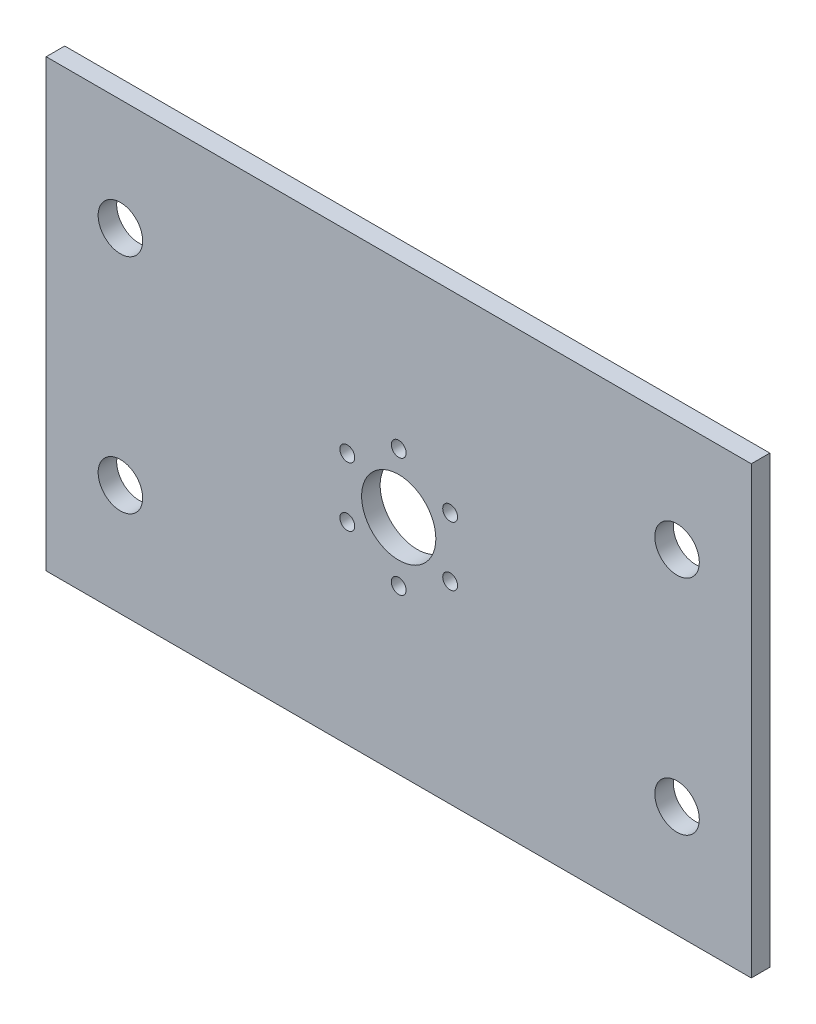
ISO-10303-21;
HEADER;
FILE_DESCRIPTION(('STEP AP214'),'2;1');
FILE_NAME('part.step','',(''),(''),'','','');
FILE_SCHEMA(('AUTOMOTIVE_DESIGN { 1 0 10303 214 1 1 1 1 }'));
ENDSEC;
DATA;
#1=APPLICATION_CONTEXT('core data for automotive mechanical design processes');
#2=APPLICATION_PROTOCOL_DEFINITION('international standard','automotive_design',2000,#1);
#3=PRODUCT_CONTEXT('',#1,'mechanical');
#4=PRODUCT('Part','Part','',(#3));
#5=PRODUCT_RELATED_PRODUCT_CATEGORY('part','',(#4));
#6=PRODUCT_DEFINITION_FORMATION('','',#4);
#7=PRODUCT_DEFINITION_CONTEXT('part definition',#1,'design');
#8=PRODUCT_DEFINITION('design','',#6,#7);
#9=PRODUCT_DEFINITION_SHAPE('','',#8);
#10=(LENGTH_UNIT() NAMED_UNIT(*) SI_UNIT(.MILLI.,.METRE.));
#11=(NAMED_UNIT(*) PLANE_ANGLE_UNIT() SI_UNIT($,.RADIAN.));
#12=(NAMED_UNIT(*) SI_UNIT($,.STERADIAN.) SOLID_ANGLE_UNIT());
#13=UNCERTAINTY_MEASURE_WITH_UNIT(LENGTH_MEASURE(1.E-05),#10,'distance_accuracy_value','');
#14=(GEOMETRIC_REPRESENTATION_CONTEXT(3) GLOBAL_UNCERTAINTY_ASSIGNED_CONTEXT((#13)) GLOBAL_UNIT_ASSIGNED_CONTEXT((#10,
#11,#12)) REPRESENTATION_CONTEXT('',''));
#15=CARTESIAN_POINT('',(0.,0.,0.));
#16=DIRECTION('',(0.,0.,1.));
#17=DIRECTION('',(1.,0.,0.));
#18=AXIS2_PLACEMENT_3D('',#15,#16,#17);
#19=CARTESIAN_POINT('',(0.,0.,5.));
#20=DIRECTION('',(0.,0.,1.));
#21=DIRECTION('',(1.,0.,0.));
#22=AXIS2_PLACEMENT_3D('',#19,#20,#21);
#23=PLANE('',#22);
#24=CARTESIAN_POINT('',(-13.8564064605511,-7.99999999999987,5.));
#25=DIRECTION('',(0.,0.,1.));
#26=DIRECTION('',(1.,0.,0.));
#27=AXIS2_PLACEMENT_3D('',#24,#25,#26);
#28=CIRCLE('',#27,2.);
#29=CARTESIAN_POINT('',(-11.8564064605511,-7.99999999999987,5.));
#30=VERTEX_POINT('',#29);
#31=EDGE_CURVE('E198',#30,#30,#28,.T.);
#32=ORIENTED_EDGE('',*,*,#31,.F.);
#33=EDGE_LOOP('',(#32));
#34=FACE_BOUND('',#33,.T.);
#35=CARTESIAN_POINT('',(13.856406460551,-8.00000000000007,5.));
#36=DIRECTION('',(0.,0.,1.));
#37=DIRECTION('',(1.,0.,0.));
#38=AXIS2_PLACEMENT_3D('',#35,#36,#37);
#39=CIRCLE('',#38,2.);
#40=CARTESIAN_POINT('',(15.856406460551,-8.00000000000007,5.));
#41=VERTEX_POINT('',#40);
#42=EDGE_CURVE('E182',#41,#41,#39,.T.);
#43=ORIENTED_EDGE('',*,*,#42,.F.);
#44=EDGE_LOOP('',(#43));
#45=FACE_BOUND('',#44,.T.);
#46=CARTESIAN_POINT('',(0.,16.,5.));
#47=DIRECTION('',(0.,0.,1.));
#48=DIRECTION('',(1.,0.,0.));
#49=AXIS2_PLACEMENT_3D('',#46,#47,#48);
#50=CIRCLE('',#49,2.);
#51=CARTESIAN_POINT('',(2.,16.,5.));
#52=VERTEX_POINT('',#51);
#53=EDGE_CURVE('E166',#52,#52,#50,.T.);
#54=ORIENTED_EDGE('',*,*,#53,.F.);
#55=EDGE_LOOP('',(#54));
#56=FACE_BOUND('',#55,.T.);
#57=CARTESIAN_POINT('',(-75.,-30.,5.));
#58=DIRECTION('',(0.,0.,1.));
#59=DIRECTION('',(1.,0.,0.));
#60=AXIS2_PLACEMENT_3D('',#57,#58,#59);
#61=CIRCLE('',#60,6.);
#62=CARTESIAN_POINT('',(-69.,-30.,5.));
#63=VERTEX_POINT('',#62);
#64=EDGE_CURVE('E150',#63,#63,#61,.T.);
#65=ORIENTED_EDGE('',*,*,#64,.F.);
#66=EDGE_LOOP('',(#65));
#67=FACE_BOUND('',#66,.T.);
#68=CARTESIAN_POINT('',(75.,30.,5.));
#69=DIRECTION('',(0.,0.,1.));
#70=DIRECTION('',(1.,0.,0.));
#71=AXIS2_PLACEMENT_3D('',#68,#69,#70);
#72=CIRCLE('',#71,6.);
#73=CARTESIAN_POINT('',(81.,30.,5.));
#74=VERTEX_POINT('',#73);
#75=EDGE_CURVE('E134',#74,#74,#72,.T.);
#76=ORIENTED_EDGE('',*,*,#75,.F.);
#77=EDGE_LOOP('',(#76));
#78=FACE_BOUND('',#77,.T.);
#79=DIRECTION('',(0.,1.,0.));
#80=VECTOR('',#79,1.);
#81=CARTESIAN_POINT('',(95.,60.,5.));
#82=LINE('',#81,#80);
#83=CARTESIAN_POINT('',(95.,-60.,5.));
#84=VERTEX_POINT('',#83);
#85=CARTESIAN_POINT('',(95.,60.,5.));
#86=VERTEX_POINT('',#85);
#87=EDGE_CURVE('E92',#84,#86,#82,.T.);
#88=ORIENTED_EDGE('',*,*,#87,.T.);
#89=DIRECTION('',(-1.,0.,0.));
#90=VECTOR('',#89,1.);
#91=CARTESIAN_POINT('',(-95.,60.0000000000001,5.));
#92=LINE('',#91,#90);
#93=CARTESIAN_POINT('',(-95.,60.0000000000001,5.));
#94=VERTEX_POINT('',#93);
#95=EDGE_CURVE('E87',#86,#94,#92,.T.);
#96=ORIENTED_EDGE('',*,*,#95,.T.);
#97=DIRECTION('',(0.,-1.,0.));
#98=VECTOR('',#97,1.);
#99=CARTESIAN_POINT('',(-95.,60.0000000000001,5.));
#100=LINE('',#99,#98);
#101=CARTESIAN_POINT('',(-95.,-60.,5.));
#102=VERTEX_POINT('',#101);
#103=EDGE_CURVE('E90',#94,#102,#100,.T.);
#104=ORIENTED_EDGE('',*,*,#103,.T.);
#105=DIRECTION('',(1.,0.,0.));
#106=VECTOR('',#105,1.);
#107=CARTESIAN_POINT('',(-95.,-60.,5.));
#108=LINE('',#107,#106);
#109=EDGE_CURVE('E57',#102,#84,#108,.T.);
#110=ORIENTED_EDGE('',*,*,#109,.T.);
#111=EDGE_LOOP('',(#88,#96,#104,#110));
#112=FACE_BOUND('',#111,.T.);
#113=CARTESIAN_POINT('',(-75.,30.,5.));
#114=DIRECTION('',(0.,0.,1.));
#115=DIRECTION('',(1.,0.,0.));
#116=AXIS2_PLACEMENT_3D('',#113,#114,#115);
#117=CIRCLE('',#116,6.);
#118=CARTESIAN_POINT('',(-69.,30.,5.));
#119=VERTEX_POINT('',#118);
#120=EDGE_CURVE('E112',#119,#119,#117,.T.);
#121=ORIENTED_EDGE('',*,*,#120,.F.);
#122=EDGE_LOOP('',(#121));
#123=FACE_BOUND('',#122,.T.);
#124=CARTESIAN_POINT('',(75.,-30.,5.));
#125=DIRECTION('',(0.,0.,1.));
#126=DIRECTION('',(1.,0.,0.));
#127=AXIS2_PLACEMENT_3D('',#124,#125,#126);
#128=CIRCLE('',#127,6.);
#129=CARTESIAN_POINT('',(81.,-30.,5.));
#130=VERTEX_POINT('',#129);
#131=EDGE_CURVE('E142',#130,#130,#128,.T.);
#132=ORIENTED_EDGE('',*,*,#131,.F.);
#133=EDGE_LOOP('',(#132));
#134=FACE_BOUND('',#133,.T.);
#135=CARTESIAN_POINT('',(0.,0.,5.));
#136=DIRECTION('',(0.,0.,1.));
#137=DIRECTION('',(1.,0.,0.));
#138=AXIS2_PLACEMENT_3D('',#135,#136,#137);
#139=CIRCLE('',#138,10.);
#140=CARTESIAN_POINT('',(10.,0.,5.));
#141=VERTEX_POINT('',#140);
#142=EDGE_CURVE('E158',#141,#141,#139,.T.);
#143=ORIENTED_EDGE('',*,*,#142,.F.);
#144=EDGE_LOOP('',(#143));
#145=FACE_BOUND('',#144,.T.);
#146=CARTESIAN_POINT('',(13.856406460551,7.99999999999997,5.));
#147=DIRECTION('',(0.,0.,1.));
#148=DIRECTION('',(1.,0.,0.));
#149=AXIS2_PLACEMENT_3D('',#146,#147,#148);
#150=CIRCLE('',#149,2.);
#151=CARTESIAN_POINT('',(15.856406460551,7.99999999999997,5.));
#152=VERTEX_POINT('',#151);
#153=EDGE_CURVE('E174',#152,#152,#150,.T.);
#154=ORIENTED_EDGE('',*,*,#153,.F.);
#155=EDGE_LOOP('',(#154));
#156=FACE_BOUND('',#155,.T.);
#157=CARTESIAN_POINT('',(-1.1172740284298E-13,-16.,5.));
#158=DIRECTION('',(0.,0.,1.));
#159=DIRECTION('',(1.,0.,0.));
#160=AXIS2_PLACEMENT_3D('',#157,#158,#159);
#161=CIRCLE('',#160,2.);
#162=CARTESIAN_POINT('',(1.99999999999989,-16.,5.));
#163=VERTEX_POINT('',#162);
#164=EDGE_CURVE('E190',#163,#163,#161,.T.);
#165=ORIENTED_EDGE('',*,*,#164,.F.);
#166=EDGE_LOOP('',(#165));
#167=FACE_BOUND('',#166,.T.);
#168=CARTESIAN_POINT('',(-13.8564064605509,8.00000000000016,5.));
#169=DIRECTION('',(0.,0.,1.));
#170=DIRECTION('',(1.,0.,0.));
#171=AXIS2_PLACEMENT_3D('',#168,#169,#170);
#172=CIRCLE('',#171,2.);
#173=CARTESIAN_POINT('',(-11.8564064605509,8.00000000000016,5.));
#174=VERTEX_POINT('',#173);
#175=EDGE_CURVE('E206',#174,#174,#172,.T.);
#176=ORIENTED_EDGE('',*,*,#175,.F.);
#177=EDGE_LOOP('',(#176));
#178=FACE_BOUND('',#177,.T.);
#179=ADVANCED_FACE('F39',(#34,#45,#56,#67,#78,#112,#123,#134,#145,#156,#167,#178),#23,.T.);
#180=CARTESIAN_POINT('',(0.,0.,0.));
#181=DIRECTION('',(0.,0.,1.));
#182=DIRECTION('',(1.,0.,0.));
#183=AXIS2_PLACEMENT_3D('',#180,#181,#182);
#184=PLANE('',#183);
#185=DIRECTION('',(0.,1.,0.));
#186=VECTOR('',#185,1.);
#187=CARTESIAN_POINT('',(95.,60.,0.));
#188=LINE('',#187,#186);
#189=CARTESIAN_POINT('',(95.,-60.,0.));
#190=VERTEX_POINT('',#189);
#191=CARTESIAN_POINT('',(95.,60.,0.));
#192=VERTEX_POINT('',#191);
#193=EDGE_CURVE('E108',#190,#192,#188,.T.);
#194=ORIENTED_EDGE('',*,*,#193,.F.);
#195=DIRECTION('',(1.,0.,0.));
#196=VECTOR('',#195,1.);
#197=CARTESIAN_POINT('',(-95.,-60.,0.));
#198=LINE('',#197,#196);
#199=CARTESIAN_POINT('',(-95.,-60.,0.));
#200=VERTEX_POINT('',#199);
#201=EDGE_CURVE('E80',#200,#190,#198,.T.);
#202=ORIENTED_EDGE('',*,*,#201,.F.);
#203=DIRECTION('',(0.,-1.,0.));
#204=VECTOR('',#203,1.);
#205=CARTESIAN_POINT('',(-95.,60.0000000000001,0.));
#206=LINE('',#205,#204);
#207=CARTESIAN_POINT('',(-95.,60.0000000000001,0.));
#208=VERTEX_POINT('',#207);
#209=EDGE_CURVE('E74',#208,#200,#206,.T.);
#210=ORIENTED_EDGE('',*,*,#209,.F.);
#211=DIRECTION('',(-1.,0.,0.));
#212=VECTOR('',#211,1.);
#213=CARTESIAN_POINT('',(-95.,60.0000000000001,0.));
#214=LINE('',#213,#212);
#215=EDGE_CURVE('E97',#192,#208,#214,.T.);
#216=ORIENTED_EDGE('',*,*,#215,.F.);
#217=EDGE_LOOP('',(#194,#202,#210,#216));
#218=FACE_BOUND('',#217,.T.);
#219=CARTESIAN_POINT('',(-75.,30.,0.));
#220=DIRECTION('',(0.,0.,1.));
#221=DIRECTION('',(1.,0.,0.));
#222=AXIS2_PLACEMENT_3D('',#219,#220,#221);
#223=CIRCLE('',#222,6.);
#224=CARTESIAN_POINT('',(-69.,30.,0.));
#225=VERTEX_POINT('',#224);
#226=EDGE_CURVE('E130',#225,#225,#223,.T.);
#227=ORIENTED_EDGE('',*,*,#226,.T.);
#228=EDGE_LOOP('',(#227));
#229=FACE_BOUND('',#228,.T.);
#230=CARTESIAN_POINT('',(75.,30.,0.));
#231=DIRECTION('',(0.,0.,1.));
#232=DIRECTION('',(1.,0.,0.));
#233=AXIS2_PLACEMENT_3D('',#230,#231,#232);
#234=CIRCLE('',#233,6.);
#235=CARTESIAN_POINT('',(81.,30.,0.));
#236=VERTEX_POINT('',#235);
#237=EDGE_CURVE('E138',#236,#236,#234,.T.);
#238=ORIENTED_EDGE('',*,*,#237,.T.);
#239=EDGE_LOOP('',(#238));
#240=FACE_BOUND('',#239,.T.);
#241=CARTESIAN_POINT('',(75.,-30.,0.));
#242=DIRECTION('',(0.,0.,1.));
#243=DIRECTION('',(1.,0.,0.));
#244=AXIS2_PLACEMENT_3D('',#241,#242,#243);
#245=CIRCLE('',#244,6.);
#246=CARTESIAN_POINT('',(81.,-30.,0.));
#247=VERTEX_POINT('',#246);
#248=EDGE_CURVE('E146',#247,#247,#245,.T.);
#249=ORIENTED_EDGE('',*,*,#248,.T.);
#250=EDGE_LOOP('',(#249));
#251=FACE_BOUND('',#250,.T.);
#252=CARTESIAN_POINT('',(-75.,-30.,0.));
#253=DIRECTION('',(0.,0.,1.));
#254=DIRECTION('',(1.,0.,0.));
#255=AXIS2_PLACEMENT_3D('',#252,#253,#254);
#256=CIRCLE('',#255,6.);
#257=CARTESIAN_POINT('',(-69.,-30.,0.));
#258=VERTEX_POINT('',#257);
#259=EDGE_CURVE('E154',#258,#258,#256,.T.);
#260=ORIENTED_EDGE('',*,*,#259,.T.);
#261=EDGE_LOOP('',(#260));
#262=FACE_BOUND('',#261,.T.);
#263=CARTESIAN_POINT('',(0.,0.,0.));
#264=DIRECTION('',(0.,0.,1.));
#265=DIRECTION('',(1.,0.,0.));
#266=AXIS2_PLACEMENT_3D('',#263,#264,#265);
#267=CIRCLE('',#266,10.);
#268=CARTESIAN_POINT('',(10.,0.,0.));
#269=VERTEX_POINT('',#268);
#270=EDGE_CURVE('E162',#269,#269,#267,.T.);
#271=ORIENTED_EDGE('',*,*,#270,.T.);
#272=EDGE_LOOP('',(#271));
#273=FACE_BOUND('',#272,.T.);
#274=CARTESIAN_POINT('',(0.,16.,0.));
#275=DIRECTION('',(0.,0.,1.));
#276=DIRECTION('',(1.,0.,0.));
#277=AXIS2_PLACEMENT_3D('',#274,#275,#276);
#278=CIRCLE('',#277,2.);
#279=CARTESIAN_POINT('',(2.,16.,0.));
#280=VERTEX_POINT('',#279);
#281=EDGE_CURVE('E170',#280,#280,#278,.T.);
#282=ORIENTED_EDGE('',*,*,#281,.T.);
#283=EDGE_LOOP('',(#282));
#284=FACE_BOUND('',#283,.T.);
#285=CARTESIAN_POINT('',(13.856406460551,7.99999999999997,0.));
#286=DIRECTION('',(0.,0.,1.));
#287=DIRECTION('',(1.,0.,0.));
#288=AXIS2_PLACEMENT_3D('',#285,#286,#287);
#289=CIRCLE('',#288,2.);
#290=CARTESIAN_POINT('',(15.856406460551,7.99999999999997,0.));
#291=VERTEX_POINT('',#290);
#292=EDGE_CURVE('E178',#291,#291,#289,.T.);
#293=ORIENTED_EDGE('',*,*,#292,.T.);
#294=EDGE_LOOP('',(#293));
#295=FACE_BOUND('',#294,.T.);
#296=CARTESIAN_POINT('',(13.856406460551,-8.00000000000007,0.));
#297=DIRECTION('',(0.,0.,1.));
#298=DIRECTION('',(1.,0.,0.));
#299=AXIS2_PLACEMENT_3D('',#296,#297,#298);
#300=CIRCLE('',#299,2.);
#301=CARTESIAN_POINT('',(15.856406460551,-8.00000000000007,0.));
#302=VERTEX_POINT('',#301);
#303=EDGE_CURVE('E186',#302,#302,#300,.T.);
#304=ORIENTED_EDGE('',*,*,#303,.T.);
#305=EDGE_LOOP('',(#304));
#306=FACE_BOUND('',#305,.T.);
#307=CARTESIAN_POINT('',(-1.1172740284298E-13,-16.,0.));
#308=DIRECTION('',(0.,0.,1.));
#309=DIRECTION('',(1.,0.,0.));
#310=AXIS2_PLACEMENT_3D('',#307,#308,#309);
#311=CIRCLE('',#310,2.);
#312=CARTESIAN_POINT('',(1.99999999999989,-16.,0.));
#313=VERTEX_POINT('',#312);
#314=EDGE_CURVE('E194',#313,#313,#311,.T.);
#315=ORIENTED_EDGE('',*,*,#314,.T.);
#316=EDGE_LOOP('',(#315));
#317=FACE_BOUND('',#316,.T.);
#318=CARTESIAN_POINT('',(-13.8564064605511,-7.99999999999987,0.));
#319=DIRECTION('',(0.,0.,1.));
#320=DIRECTION('',(1.,0.,0.));
#321=AXIS2_PLACEMENT_3D('',#318,#319,#320);
#322=CIRCLE('',#321,2.);
#323=CARTESIAN_POINT('',(-11.8564064605511,-7.99999999999987,0.));
#324=VERTEX_POINT('',#323);
#325=EDGE_CURVE('E202',#324,#324,#322,.T.);
#326=ORIENTED_EDGE('',*,*,#325,.T.);
#327=EDGE_LOOP('',(#326));
#328=FACE_BOUND('',#327,.T.);
#329=CARTESIAN_POINT('',(-13.8564064605509,8.00000000000016,0.));
#330=DIRECTION('',(0.,0.,1.));
#331=DIRECTION('',(1.,0.,0.));
#332=AXIS2_PLACEMENT_3D('',#329,#330,#331);
#333=CIRCLE('',#332,2.);
#334=CARTESIAN_POINT('',(-11.8564064605509,8.00000000000016,0.));
#335=VERTEX_POINT('',#334);
#336=EDGE_CURVE('E210',#335,#335,#333,.T.);
#337=ORIENTED_EDGE('',*,*,#336,.T.);
#338=EDGE_LOOP('',(#337));
#339=FACE_BOUND('',#338,.T.);
#340=ADVANCED_FACE('F125',(#218,#229,#240,#251,#262,#273,#284,#295,#306,#317,#328,#339),#184,.F.);
#341=CARTESIAN_POINT('',(95.,60.,5.));
#342=DIRECTION('',(-1.,0.,0.));
#343=DIRECTION('',(0.,-1.,0.));
#344=AXIS2_PLACEMENT_3D('',#341,#342,#343);
#345=PLANE('',#344);
#346=ORIENTED_EDGE('',*,*,#193,.T.);
#347=DIRECTION('',(0.,0.,-1.));
#348=VECTOR('',#347,1.);
#349=CARTESIAN_POINT('',(95.,60.,5.));
#350=LINE('',#349,#348);
#351=EDGE_CURVE('E11',#86,#192,#350,.T.);
#352=ORIENTED_EDGE('',*,*,#351,.F.);
#353=ORIENTED_EDGE('',*,*,#87,.F.);
#354=DIRECTION('',(0.,0.,-1.));
#355=VECTOR('',#354,1.);
#356=CARTESIAN_POINT('',(95.,-60.,5.));
#357=LINE('',#356,#355);
#358=EDGE_CURVE('E104',#84,#190,#357,.T.);
#359=ORIENTED_EDGE('',*,*,#358,.T.);
#360=EDGE_LOOP('',(#346,#352,#353,#359));
#361=FACE_BOUND('',#360,.T.);
#362=ADVANCED_FACE('F41',(#361),#345,.F.);
#363=CARTESIAN_POINT('',(-95.,60.0000000000001,5.));
#364=DIRECTION('',(0.,-1.,0.));
#365=DIRECTION('',(1.,0.,0.));
#366=AXIS2_PLACEMENT_3D('',#363,#364,#365);
#367=PLANE('',#366);
#368=ORIENTED_EDGE('',*,*,#215,.T.);
#369=DIRECTION('',(0.,0.,-1.));
#370=VECTOR('',#369,1.);
#371=CARTESIAN_POINT('',(-95.,60.0000000000001,5.));
#372=LINE('',#371,#370);
#373=EDGE_CURVE('E49',#94,#208,#372,.T.);
#374=ORIENTED_EDGE('',*,*,#373,.F.);
#375=ORIENTED_EDGE('',*,*,#95,.F.);
#376=ORIENTED_EDGE('',*,*,#351,.T.);
#377=EDGE_LOOP('',(#368,#374,#375,#376));
#378=FACE_BOUND('',#377,.T.);
#379=ADVANCED_FACE('F96',(#378),#367,.F.);
#380=CARTESIAN_POINT('',(-95.,60.0000000000001,5.));
#381=DIRECTION('',(1.,0.,0.));
#382=DIRECTION('',(0.,0.,-1.));
#383=AXIS2_PLACEMENT_3D('',#380,#381,#382);
#384=PLANE('',#383);
#385=ORIENTED_EDGE('',*,*,#209,.T.);
#386=DIRECTION('',(0.,0.,-1.));
#387=VECTOR('',#386,1.);
#388=CARTESIAN_POINT('',(-95.,-60.,5.));
#389=LINE('',#388,#387);
#390=EDGE_CURVE('E99',#102,#200,#389,.T.);
#391=ORIENTED_EDGE('',*,*,#390,.F.);
#392=ORIENTED_EDGE('',*,*,#103,.F.);
#393=ORIENTED_EDGE('',*,*,#373,.T.);
#394=EDGE_LOOP('',(#385,#391,#392,#393));
#395=FACE_BOUND('',#394,.T.);
#396=ADVANCED_FACE('F100',(#395),#384,.F.);
#397=CARTESIAN_POINT('',(-95.,-60.,5.));
#398=DIRECTION('',(0.,1.,0.));
#399=DIRECTION('',(0.,0.,1.));
#400=AXIS2_PLACEMENT_3D('',#397,#398,#399);
#401=PLANE('',#400);
#402=ORIENTED_EDGE('',*,*,#201,.T.);
#403=ORIENTED_EDGE('',*,*,#358,.F.);
#404=ORIENTED_EDGE('',*,*,#109,.F.);
#405=ORIENTED_EDGE('',*,*,#390,.T.);
#406=EDGE_LOOP('',(#402,#403,#404,#405));
#407=FACE_BOUND('',#406,.T.);
#408=ADVANCED_FACE('F122',(#407),#401,.F.);
#409=CARTESIAN_POINT('',(-75.,30.,5.));
#410=DIRECTION('',(0.,0.,-1.));
#411=DIRECTION('',(-1.,0.,0.));
#412=AXIS2_PLACEMENT_3D('',#409,#410,#411);
#413=CYLINDRICAL_SURFACE('',#412,6.);
#414=ORIENTED_EDGE('',*,*,#120,.T.);
#415=EDGE_LOOP('',(#414));
#416=FACE_BOUND('',#415,.T.);
#417=ORIENTED_EDGE('',*,*,#226,.F.);
#418=EDGE_LOOP('',(#417));
#419=FACE_BOUND('',#418,.T.);
#420=ADVANCED_FACE('F231',(#416,#419),#413,.F.);
#421=CARTESIAN_POINT('',(75.,30.,5.));
#422=DIRECTION('',(0.,0.,-1.));
#423=DIRECTION('',(-1.,0.,0.));
#424=AXIS2_PLACEMENT_3D('',#421,#422,#423);
#425=CYLINDRICAL_SURFACE('',#424,6.);
#426=ORIENTED_EDGE('',*,*,#75,.T.);
#427=EDGE_LOOP('',(#426));
#428=FACE_BOUND('',#427,.T.);
#429=ORIENTED_EDGE('',*,*,#237,.F.);
#430=EDGE_LOOP('',(#429));
#431=FACE_BOUND('',#430,.T.);
#432=ADVANCED_FACE('F277',(#428,#431),#425,.F.);
#433=CARTESIAN_POINT('',(75.,-30.,5.));
#434=DIRECTION('',(0.,0.,-1.));
#435=DIRECTION('',(-1.,0.,0.));
#436=AXIS2_PLACEMENT_3D('',#433,#434,#435);
#437=CYLINDRICAL_SURFACE('',#436,6.);
#438=ORIENTED_EDGE('',*,*,#131,.T.);
#439=EDGE_LOOP('',(#438));
#440=FACE_BOUND('',#439,.T.);
#441=ORIENTED_EDGE('',*,*,#248,.F.);
#442=EDGE_LOOP('',(#441));
#443=FACE_BOUND('',#442,.T.);
#444=ADVANCED_FACE('F285',(#440,#443),#437,.F.);
#445=CARTESIAN_POINT('',(-75.,-30.,5.));
#446=DIRECTION('',(0.,0.,-1.));
#447=DIRECTION('',(-1.,0.,0.));
#448=AXIS2_PLACEMENT_3D('',#445,#446,#447);
#449=CYLINDRICAL_SURFACE('',#448,6.);
#450=ORIENTED_EDGE('',*,*,#64,.T.);
#451=EDGE_LOOP('',(#450));
#452=FACE_BOUND('',#451,.T.);
#453=ORIENTED_EDGE('',*,*,#259,.F.);
#454=EDGE_LOOP('',(#453));
#455=FACE_BOUND('',#454,.T.);
#456=ADVANCED_FACE('F293',(#452,#455),#449,.F.);
#457=CARTESIAN_POINT('',(0.,0.,5.));
#458=DIRECTION('',(0.,0.,-1.));
#459=DIRECTION('',(-1.,0.,0.));
#460=AXIS2_PLACEMENT_3D('',#457,#458,#459);
#461=CYLINDRICAL_SURFACE('',#460,10.);
#462=ORIENTED_EDGE('',*,*,#142,.T.);
#463=EDGE_LOOP('',(#462));
#464=FACE_BOUND('',#463,.T.);
#465=ORIENTED_EDGE('',*,*,#270,.F.);
#466=EDGE_LOOP('',(#465));
#467=FACE_BOUND('',#466,.T.);
#468=ADVANCED_FACE('F302',(#464,#467),#461,.F.);
#469=CARTESIAN_POINT('',(0.,16.,5.));
#470=DIRECTION('',(0.,0.,-1.));
#471=DIRECTION('',(-1.,0.,0.));
#472=AXIS2_PLACEMENT_3D('',#469,#470,#471);
#473=CYLINDRICAL_SURFACE('',#472,2.);
#474=ORIENTED_EDGE('',*,*,#53,.T.);
#475=EDGE_LOOP('',(#474));
#476=FACE_BOUND('',#475,.T.);
#477=ORIENTED_EDGE('',*,*,#281,.F.);
#478=EDGE_LOOP('',(#477));
#479=FACE_BOUND('',#478,.T.);
#480=ADVANCED_FACE('F311',(#476,#479),#473,.F.);
#481=CARTESIAN_POINT('',(13.856406460551,7.99999999999997,5.));
#482=DIRECTION('',(0.,0.,-1.));
#483=DIRECTION('',(-1.,0.,0.));
#484=AXIS2_PLACEMENT_3D('',#481,#482,#483);
#485=CYLINDRICAL_SURFACE('',#484,2.);
#486=ORIENTED_EDGE('',*,*,#153,.T.);
#487=EDGE_LOOP('',(#486));
#488=FACE_BOUND('',#487,.T.);
#489=ORIENTED_EDGE('',*,*,#292,.F.);
#490=EDGE_LOOP('',(#489));
#491=FACE_BOUND('',#490,.T.);
#492=ADVANCED_FACE('F320',(#488,#491),#485,.F.);
#493=CARTESIAN_POINT('',(13.856406460551,-8.00000000000007,5.));
#494=DIRECTION('',(0.,0.,-1.));
#495=DIRECTION('',(-1.,0.,0.));
#496=AXIS2_PLACEMENT_3D('',#493,#494,#495);
#497=CYLINDRICAL_SURFACE('',#496,2.);
#498=ORIENTED_EDGE('',*,*,#42,.T.);
#499=EDGE_LOOP('',(#498));
#500=FACE_BOUND('',#499,.T.);
#501=ORIENTED_EDGE('',*,*,#303,.F.);
#502=EDGE_LOOP('',(#501));
#503=FACE_BOUND('',#502,.T.);
#504=ADVANCED_FACE('F329',(#500,#503),#497,.F.);
#505=CARTESIAN_POINT('',(-1.1172740284298E-13,-16.,5.));
#506=DIRECTION('',(0.,0.,-1.));
#507=DIRECTION('',(-1.,0.,0.));
#508=AXIS2_PLACEMENT_3D('',#505,#506,#507);
#509=CYLINDRICAL_SURFACE('',#508,2.);
#510=ORIENTED_EDGE('',*,*,#164,.T.);
#511=EDGE_LOOP('',(#510));
#512=FACE_BOUND('',#511,.T.);
#513=ORIENTED_EDGE('',*,*,#314,.F.);
#514=EDGE_LOOP('',(#513));
#515=FACE_BOUND('',#514,.T.);
#516=ADVANCED_FACE('F338',(#512,#515),#509,.F.);
#517=CARTESIAN_POINT('',(-13.8564064605511,-7.99999999999987,5.));
#518=DIRECTION('',(0.,0.,-1.));
#519=DIRECTION('',(-1.,0.,0.));
#520=AXIS2_PLACEMENT_3D('',#517,#518,#519);
#521=CYLINDRICAL_SURFACE('',#520,2.);
#522=ORIENTED_EDGE('',*,*,#31,.T.);
#523=EDGE_LOOP('',(#522));
#524=FACE_BOUND('',#523,.T.);
#525=ORIENTED_EDGE('',*,*,#325,.F.);
#526=EDGE_LOOP('',(#525));
#527=FACE_BOUND('',#526,.T.);
#528=ADVANCED_FACE('F347',(#524,#527),#521,.F.);
#529=CARTESIAN_POINT('',(-13.8564064605509,8.00000000000016,5.));
#530=DIRECTION('',(0.,0.,-1.));
#531=DIRECTION('',(-1.,0.,0.));
#532=AXIS2_PLACEMENT_3D('',#529,#530,#531);
#533=CYLINDRICAL_SURFACE('',#532,2.);
#534=ORIENTED_EDGE('',*,*,#175,.T.);
#535=EDGE_LOOP('',(#534));
#536=FACE_BOUND('',#535,.T.);
#537=ORIENTED_EDGE('',*,*,#336,.F.);
#538=EDGE_LOOP('',(#537));
#539=FACE_BOUND('',#538,.T.);
#540=ADVANCED_FACE('F218',(#536,#539),#533,.F.);
#541=CLOSED_SHELL('',(#179,#340,#362,#379,#396,#408,#420,#432,#444,#456,#468,#480,#492,#504,
#516,#528,#540));
#542=MANIFOLD_SOLID_BREP('B2',#541);
#543=ADVANCED_BREP_SHAPE_REPRESENTATION('',(#18,#542),#14);
#544=SHAPE_DEFINITION_REPRESENTATION(#9,#543);
ENDSEC;
END-ISO-10303-21;
